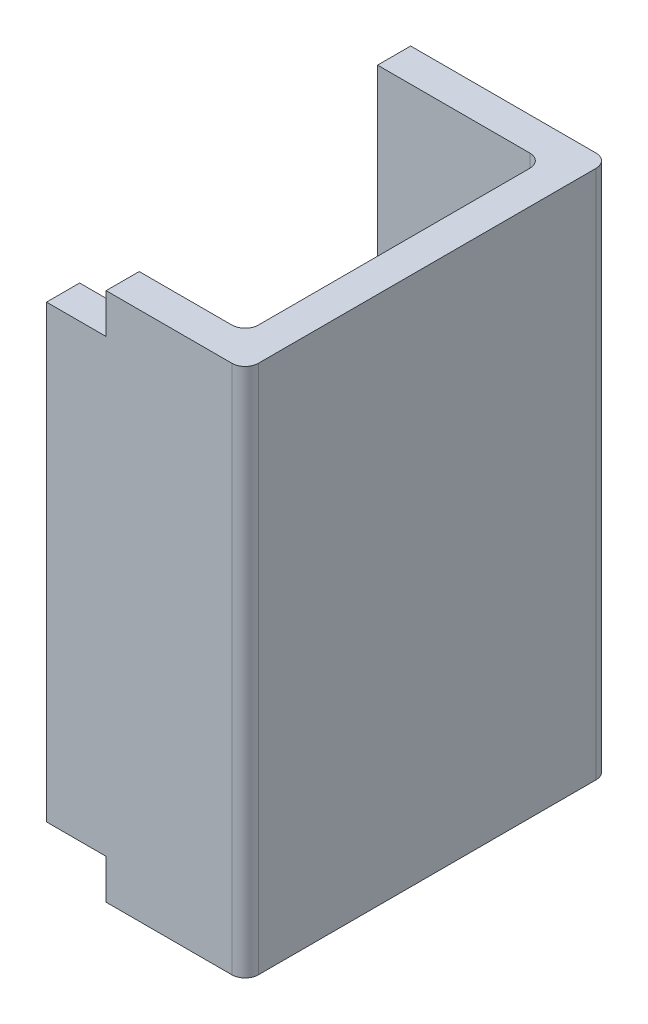
ISO-10303-21;
HEADER;
FILE_DESCRIPTION(('STEP AP214'),'2;1');
FILE_NAME('part.step','',(''),(''),'','','');
FILE_SCHEMA(('AUTOMOTIVE_DESIGN { 1 0 10303 214 1 1 1 1 }'));
ENDSEC;
DATA;
#1=APPLICATION_CONTEXT('core data for automotive mechanical design processes');
#2=APPLICATION_PROTOCOL_DEFINITION('international standard','automotive_design',2000,#1);
#3=PRODUCT_CONTEXT('',#1,'mechanical');
#4=PRODUCT('Part','Part','',(#3));
#5=PRODUCT_RELATED_PRODUCT_CATEGORY('part','',(#4));
#6=PRODUCT_DEFINITION_FORMATION('','',#4);
#7=PRODUCT_DEFINITION_CONTEXT('part definition',#1,'design');
#8=PRODUCT_DEFINITION('design','',#6,#7);
#9=PRODUCT_DEFINITION_SHAPE('','',#8);
#10=(LENGTH_UNIT() NAMED_UNIT(*) SI_UNIT(.MILLI.,.METRE.));
#11=(NAMED_UNIT(*) PLANE_ANGLE_UNIT() SI_UNIT($,.RADIAN.));
#12=(NAMED_UNIT(*) SI_UNIT($,.STERADIAN.) SOLID_ANGLE_UNIT());
#13=UNCERTAINTY_MEASURE_WITH_UNIT(LENGTH_MEASURE(1.E-05),#10,'distance_accuracy_value','');
#14=(GEOMETRIC_REPRESENTATION_CONTEXT(3) GLOBAL_UNCERTAINTY_ASSIGNED_CONTEXT((#13)) GLOBAL_UNIT_ASSIGNED_CONTEXT((#10,
#11,#12)) REPRESENTATION_CONTEXT('',''));
#15=CARTESIAN_POINT('',(0.,0.,0.));
#16=DIRECTION('',(0.,0.,1.));
#17=DIRECTION('',(1.,0.,0.));
#18=AXIS2_PLACEMENT_3D('',#15,#16,#17);
#19=CARTESIAN_POINT('',(0.565,0.34,0.55));
#20=DIRECTION('',(0.,-1.,0.));
#21=DIRECTION('',(0.,0.,-1.));
#22=AXIS2_PLACEMENT_3D('',#19,#20,#21);
#23=PLANE('',#22);
#24=DIRECTION('',(0.,0.,-1.));
#25=VECTOR('',#24,1.);
#26=CARTESIAN_POINT('',(0.475,0.34,0.55));
#27=LINE('',#26,#25);
#28=CARTESIAN_POINT('',(0.475,0.34,0.5));
#29=VERTEX_POINT('',#28);
#30=CARTESIAN_POINT('',(0.475,0.34,0.55));
#31=VERTEX_POINT('',#30);
#32=EDGE_CURVE('E210',#29,#31,#27,.F.);
#33=ORIENTED_EDGE('',*,*,#32,.T.);
#34=DIRECTION('',(1.,0.,0.));
#35=VECTOR('',#34,1.);
#36=CARTESIAN_POINT('',(0.,0.34,0.55));
#37=LINE('',#36,#35);
#38=CARTESIAN_POINT('',(0.565,0.34,0.55));
#39=VERTEX_POINT('',#38);
#40=EDGE_CURVE('E180',#39,#31,#37,.F.);
#41=ORIENTED_EDGE('',*,*,#40,.F.);
#42=DIRECTION('',(0.,0.,-1.));
#43=VECTOR('',#42,1.);
#44=CARTESIAN_POINT('',(0.565,0.34,0.55));
#45=LINE('',#44,#43);
#46=CARTESIAN_POINT('',(0.565,0.34,0.5));
#47=VERTEX_POINT('',#46);
#48=EDGE_CURVE('E181',#39,#47,#45,.T.);
#49=ORIENTED_EDGE('',*,*,#48,.T.);
#50=DIRECTION('',(1.,0.,0.));
#51=VECTOR('',#50,1.);
#52=CARTESIAN_POINT('',(-0.725,0.34,0.5));
#53=LINE('',#52,#51);
#54=EDGE_CURVE('E190',#47,#29,#53,.F.);
#55=ORIENTED_EDGE('',*,*,#54,.T.);
#56=EDGE_LOOP('',(#33,#41,#49,#55));
#57=FACE_BOUND('',#56,.T.);
#58=ADVANCED_FACE('F17',(#57),#23,.F.);
#59=CARTESIAN_POINT('',(0.475,0.4,0.55));
#60=DIRECTION('',(1.,0.,0.));
#61=DIRECTION('',(0.,0.,-1.));
#62=AXIS2_PLACEMENT_3D('',#59,#60,#61);
#63=PLANE('',#62);
#64=DIRECTION('',(0.,1.,0.));
#65=VECTOR('',#64,1.);
#66=CARTESIAN_POINT('',(0.475,0.,0.55));
#67=LINE('',#66,#65);
#68=CARTESIAN_POINT('',(0.475,-0.34,0.55));
#69=VERTEX_POINT('',#68);
#70=EDGE_CURVE('E231',#31,#69,#67,.F.);
#71=ORIENTED_EDGE('',*,*,#70,.F.);
#72=ORIENTED_EDGE('',*,*,#32,.F.);
#73=DIRECTION('',(0.,1.,0.));
#74=VECTOR('',#73,1.);
#75=CARTESIAN_POINT('',(0.475,0.4,0.5));
#76=LINE('',#75,#74);
#77=CARTESIAN_POINT('',(0.475,-0.34,0.5));
#78=VERTEX_POINT('',#77);
#79=EDGE_CURVE('E204',#29,#78,#76,.F.);
#80=ORIENTED_EDGE('',*,*,#79,.T.);
#81=DIRECTION('',(0.,0.,1.));
#82=VECTOR('',#81,1.);
#83=CARTESIAN_POINT('',(0.475,-0.34,0.55));
#84=LINE('',#83,#82);
#85=EDGE_CURVE('E207',#78,#69,#84,.T.);
#86=ORIENTED_EDGE('',*,*,#85,.T.);
#87=EDGE_LOOP('',(#71,#72,#80,#86));
#88=FACE_BOUND('',#87,.T.);
#89=ADVANCED_FACE('F346',(#88),#63,.F.);
#90=CARTESIAN_POINT('',(0.475,-0.34,0.55));
#91=DIRECTION('',(0.,1.,0.));
#92=DIRECTION('',(0.,0.,1.));
#93=AXIS2_PLACEMENT_3D('',#90,#91,#92);
#94=PLANE('',#93);
#95=DIRECTION('',(0.,0.,-1.));
#96=VECTOR('',#95,1.);
#97=CARTESIAN_POINT('',(0.565,-0.34,0.55));
#98=LINE('',#97,#96);
#99=CARTESIAN_POINT('',(0.565,-0.34,0.5));
#100=VERTEX_POINT('',#99);
#101=CARTESIAN_POINT('',(0.565,-0.34,0.55));
#102=VERTEX_POINT('',#101);
#103=EDGE_CURVE('E170',#100,#102,#98,.F.);
#104=ORIENTED_EDGE('',*,*,#103,.T.);
#105=DIRECTION('',(1.,0.,0.));
#106=VECTOR('',#105,1.);
#107=CARTESIAN_POINT('',(0.,-0.34,0.55));
#108=LINE('',#107,#106);
#109=EDGE_CURVE('E199',#69,#102,#108,.T.);
#110=ORIENTED_EDGE('',*,*,#109,.F.);
#111=ORIENTED_EDGE('',*,*,#85,.F.);
#112=DIRECTION('',(1.,0.,0.));
#113=VECTOR('',#112,1.);
#114=CARTESIAN_POINT('',(-0.725,-0.34,0.5));
#115=LINE('',#114,#113);
#116=EDGE_CURVE('E156',#78,#100,#115,.T.);
#117=ORIENTED_EDGE('',*,*,#116,.T.);
#118=EDGE_LOOP('',(#104,#110,#111,#117));
#119=FACE_BOUND('',#118,.T.);
#120=ADVANCED_FACE('F350',(#119),#94,.F.);
#121=CARTESIAN_POINT('',(0.565,0.4,0.55));
#122=DIRECTION('',(1.,0.,0.));
#123=DIRECTION('',(0.,0.,-1.));
#124=AXIS2_PLACEMENT_3D('',#121,#122,#123);
#125=PLANE('',#124);
#126=ORIENTED_EDGE('',*,*,#48,.F.);
#127=DIRECTION('',(0.,1.,0.));
#128=VECTOR('',#127,1.);
#129=CARTESIAN_POINT('',(0.565,0.,0.55));
#130=LINE('',#129,#128);
#131=CARTESIAN_POINT('',(0.565,0.4,0.55));
#132=VERTEX_POINT('',#131);
#133=EDGE_CURVE('E177',#132,#39,#130,.F.);
#134=ORIENTED_EDGE('',*,*,#133,.F.);
#135=DIRECTION('',(0.,0.,1.));
#136=VECTOR('',#135,1.);
#137=CARTESIAN_POINT('',(0.565,0.4,0.));
#138=LINE('',#137,#136);
#139=CARTESIAN_POINT('',(0.565,0.4,0.5));
#140=VERTEX_POINT('',#139);
#141=EDGE_CURVE('E104',#140,#132,#138,.T.);
#142=ORIENTED_EDGE('',*,*,#141,.F.);
#143=DIRECTION('',(0.,1.,0.));
#144=VECTOR('',#143,1.);
#145=CARTESIAN_POINT('',(0.565,0.4,0.5));
#146=LINE('',#145,#144);
#147=EDGE_CURVE('E169',#140,#47,#146,.F.);
#148=ORIENTED_EDGE('',*,*,#147,.T.);
#149=EDGE_LOOP('',(#126,#134,#142,#148));
#150=FACE_BOUND('',#149,.T.);
#151=ADVANCED_FACE('F285',(#150),#125,.F.);
#152=CARTESIAN_POINT('',(0.,0.,0.55));
#153=DIRECTION('',(0.,0.,1.));
#154=DIRECTION('',(1.,0.,0.));
#155=AXIS2_PLACEMENT_3D('',#152,#153,#154);
#156=PLANE('',#155);
#157=DIRECTION('',(0.,1.,0.));
#158=VECTOR('',#157,1.);
#159=CARTESIAN_POINT('',(0.565,-0.34,0.55));
#160=LINE('',#159,#158);
#161=CARTESIAN_POINT('',(0.565,-0.4,0.55));
#162=VERTEX_POINT('',#161);
#163=EDGE_CURVE('E166',#102,#162,#160,.F.);
#164=ORIENTED_EDGE('',*,*,#163,.T.);
#165=DIRECTION('',(1.,0.,0.));
#166=VECTOR('',#165,1.);
#167=CARTESIAN_POINT('',(-0.775,-0.4,0.55));
#168=LINE('',#167,#166);
#169=CARTESIAN_POINT('',(0.755,-0.4,0.55));
#170=VERTEX_POINT('',#169);
#171=EDGE_CURVE('E163',#170,#162,#168,.F.);
#172=ORIENTED_EDGE('',*,*,#171,.F.);
#173=DIRECTION('',(0.,1.,0.));
#174=VECTOR('',#173,1.);
#175=CARTESIAN_POINT('',(0.755,-0.2,0.55));
#176=LINE('',#175,#174);
#177=CARTESIAN_POINT('',(0.755,0.4,0.55));
#178=VERTEX_POINT('',#177);
#179=EDGE_CURVE('E173',#178,#170,#176,.F.);
#180=ORIENTED_EDGE('',*,*,#179,.F.);
#181=DIRECTION('',(1.,0.,0.));
#182=VECTOR('',#181,1.);
#183=CARTESIAN_POINT('',(0.775,0.4,0.55));
#184=LINE('',#183,#182);
#185=EDGE_CURVE('E102',#132,#178,#184,.T.);
#186=ORIENTED_EDGE('',*,*,#185,.F.);
#187=ORIENTED_EDGE('',*,*,#133,.T.);
#188=ORIENTED_EDGE('',*,*,#40,.T.);
#189=ORIENTED_EDGE('',*,*,#70,.T.);
#190=ORIENTED_EDGE('',*,*,#109,.T.);
#191=EDGE_LOOP('',(#164,#172,#180,#186,#187,#188,#189,#190));
#192=FACE_BOUND('',#191,.T.);
#193=ADVANCED_FACE('F292',(#192),#156,.T.);
#194=CARTESIAN_POINT('',(0.565,-0.34,0.55));
#195=DIRECTION('',(1.,0.,0.));
#196=DIRECTION('',(0.,0.,-1.));
#197=AXIS2_PLACEMENT_3D('',#194,#195,#196);
#198=PLANE('',#197);
#199=DIRECTION('',(0.,0.,-1.));
#200=VECTOR('',#199,1.);
#201=CARTESIAN_POINT('',(0.565,-0.4,0.));
#202=LINE('',#201,#200);
#203=CARTESIAN_POINT('',(0.565,-0.4,0.5));
#204=VERTEX_POINT('',#203);
#205=EDGE_CURVE('E159',#162,#204,#202,.T.);
#206=ORIENTED_EDGE('',*,*,#205,.F.);
#207=ORIENTED_EDGE('',*,*,#163,.F.);
#208=ORIENTED_EDGE('',*,*,#103,.F.);
#209=DIRECTION('',(0.,1.,0.));
#210=VECTOR('',#209,1.);
#211=CARTESIAN_POINT('',(0.565,0.4,0.5));
#212=LINE('',#211,#210);
#213=EDGE_CURVE('E153',#100,#204,#212,.F.);
#214=ORIENTED_EDGE('',*,*,#213,.T.);
#215=EDGE_LOOP('',(#206,#207,#208,#214));
#216=FACE_BOUND('',#215,.T.);
#217=ADVANCED_FACE('F353',(#216),#198,.F.);
#218=CARTESIAN_POINT('',(-0.725,0.4,0.5));
#219=DIRECTION('',(0.,0.,1.));
#220=DIRECTION('',(1.,0.,0.));
#221=AXIS2_PLACEMENT_3D('',#218,#219,#220);
#222=PLANE('',#221);
#223=DIRECTION('',(1.,0.,0.));
#224=VECTOR('',#223,1.);
#225=CARTESIAN_POINT('',(-0.775,-0.4,0.5));
#226=LINE('',#225,#224);
#227=CARTESIAN_POINT('',(0.705,-0.4,0.5));
#228=VERTEX_POINT('',#227);
#229=EDGE_CURVE('E162',#204,#228,#226,.T.);
#230=ORIENTED_EDGE('',*,*,#229,.F.);
#231=ORIENTED_EDGE('',*,*,#213,.F.);
#232=ORIENTED_EDGE('',*,*,#116,.F.);
#233=ORIENTED_EDGE('',*,*,#79,.F.);
#234=ORIENTED_EDGE('',*,*,#54,.F.);
#235=ORIENTED_EDGE('',*,*,#147,.F.);
#236=DIRECTION('',(1.,0.,0.));
#237=VECTOR('',#236,1.);
#238=CARTESIAN_POINT('',(0.775,0.4,0.5));
#239=LINE('',#238,#237);
#240=CARTESIAN_POINT('',(0.705,0.4,0.5));
#241=VERTEX_POINT('',#240);
#242=EDGE_CURVE('E107',#241,#140,#239,.F.);
#243=ORIENTED_EDGE('',*,*,#242,.F.);
#244=DIRECTION('',(0.,1.,0.));
#245=VECTOR('',#244,1.);
#246=CARTESIAN_POINT('',(0.705,0.4,0.5));
#247=LINE('',#246,#245);
#248=EDGE_CURVE('E150',#241,#228,#247,.F.);
#249=ORIENTED_EDGE('',*,*,#248,.T.);
#250=EDGE_LOOP('',(#230,#231,#232,#233,#234,#235,#243,#249));
#251=FACE_BOUND('',#250,.T.);
#252=ADVANCED_FACE('F277',(#251),#222,.F.);
#253=CARTESIAN_POINT('',(0.705,0.4,0.48));
#254=DIRECTION('',(0.,1.,0.));
#255=DIRECTION('',(0.,0.,1.));
#256=AXIS2_PLACEMENT_3D('',#253,#254,#255);
#257=CYLINDRICAL_SURFACE('',#256,0.02);
#258=ORIENTED_EDGE('',*,*,#248,.F.);
#259=CARTESIAN_POINT('',(0.705,0.4,0.48));
#260=DIRECTION('',(0.,1.,0.));
#261=DIRECTION('',(0.,0.,1.));
#262=AXIS2_PLACEMENT_3D('',#259,#260,#261);
#263=CIRCLE('',#262,0.02);
#264=CARTESIAN_POINT('',(0.725,0.4,0.48));
#265=VERTEX_POINT('',#264);
#266=EDGE_CURVE('E110',#265,#241,#263,.F.);
#267=ORIENTED_EDGE('',*,*,#266,.F.);
#268=DIRECTION('',(0.,1.,0.));
#269=VECTOR('',#268,1.);
#270=CARTESIAN_POINT('',(0.725,0.4,0.48));
#271=LINE('',#270,#269);
#272=CARTESIAN_POINT('',(0.725,-0.4,0.48));
#273=VERTEX_POINT('',#272);
#274=EDGE_CURVE('E147',#265,#273,#271,.F.);
#275=ORIENTED_EDGE('',*,*,#274,.T.);
#276=CARTESIAN_POINT('',(0.705,-0.4,0.48));
#277=DIRECTION('',(0.,1.,0.));
#278=DIRECTION('',(0.,0.,1.));
#279=AXIS2_PLACEMENT_3D('',#276,#277,#278);
#280=CIRCLE('',#279,0.02);
#281=EDGE_CURVE('E246',#228,#273,#280,.T.);
#282=ORIENTED_EDGE('',*,*,#281,.F.);
#283=EDGE_LOOP('',(#258,#267,#275,#282));
#284=FACE_BOUND('',#283,.T.);
#285=ADVANCED_FACE('F270',(#284),#257,.F.);
#286=CARTESIAN_POINT('',(0.725,0.4,0.5));
#287=DIRECTION('',(1.,0.,0.));
#288=DIRECTION('',(0.,0.,-1.));
#289=AXIS2_PLACEMENT_3D('',#286,#287,#288);
#290=PLANE('',#289);
#291=DIRECTION('',(0.,0.,-1.));
#292=VECTOR('',#291,1.);
#293=CARTESIAN_POINT('',(0.725,-0.4,0.));
#294=LINE('',#293,#292);
#295=CARTESIAN_POINT('',(0.725,-0.4,0.07));
#296=VERTEX_POINT('',#295);
#297=EDGE_CURVE('E245',#273,#296,#294,.T.);
#298=ORIENTED_EDGE('',*,*,#297,.F.);
#299=ORIENTED_EDGE('',*,*,#274,.F.);
#300=DIRECTION('',(0.,0.,1.));
#301=VECTOR('',#300,1.);
#302=CARTESIAN_POINT('',(0.725,0.4,0.));
#303=LINE('',#302,#301);
#304=CARTESIAN_POINT('',(0.725,0.4,0.07));
#305=VERTEX_POINT('',#304);
#306=EDGE_CURVE('E113',#305,#265,#303,.T.);
#307=ORIENTED_EDGE('',*,*,#306,.F.);
#308=DIRECTION('',(0.,-1.,0.));
#309=VECTOR('',#308,1.);
#310=CARTESIAN_POINT('',(0.725,0.4,0.07));
#311=LINE('',#310,#309);
#312=EDGE_CURVE('E144',#305,#296,#311,.T.);
#313=ORIENTED_EDGE('',*,*,#312,.T.);
#314=EDGE_LOOP('',(#298,#299,#307,#313));
#315=FACE_BOUND('',#314,.T.);
#316=ADVANCED_FACE('F266',(#315),#290,.F.);
#317=CARTESIAN_POINT('',(0.705,0.4,0.07));
#318=DIRECTION('',(0.,-1.,0.));
#319=DIRECTION('',(0.,0.,-1.));
#320=AXIS2_PLACEMENT_3D('',#317,#318,#319);
#321=CYLINDRICAL_SURFACE('',#320,0.02);
#322=DIRECTION('',(0.,1.,0.));
#323=VECTOR('',#322,1.);
#324=CARTESIAN_POINT('',(0.705,0.4,0.05));
#325=LINE('',#324,#323);
#326=CARTESIAN_POINT('',(0.705,0.4,0.05));
#327=VERTEX_POINT('',#326);
#328=CARTESIAN_POINT('',(0.705,-0.4,0.05));
#329=VERTEX_POINT('',#328);
#330=EDGE_CURVE('E139',#327,#329,#325,.F.);
#331=ORIENTED_EDGE('',*,*,#330,.T.);
#332=CARTESIAN_POINT('',(0.705,-0.4,0.07));
#333=DIRECTION('',(0.,-1.,0.));
#334=DIRECTION('',(0.,0.,-1.));
#335=AXIS2_PLACEMENT_3D('',#332,#333,#334);
#336=CIRCLE('',#335,0.02);
#337=EDGE_CURVE('E242',#296,#329,#336,.F.);
#338=ORIENTED_EDGE('',*,*,#337,.F.);
#339=ORIENTED_EDGE('',*,*,#312,.F.);
#340=CARTESIAN_POINT('',(0.705,0.4,0.07));
#341=DIRECTION('',(0.,-1.,0.));
#342=DIRECTION('',(0.,0.,-1.));
#343=AXIS2_PLACEMENT_3D('',#340,#341,#342);
#344=CIRCLE('',#343,0.02);
#345=EDGE_CURVE('E116',#327,#305,#344,.T.);
#346=ORIENTED_EDGE('',*,*,#345,.F.);
#347=EDGE_LOOP('',(#331,#338,#339,#346));
#348=FACE_BOUND('',#347,.T.);
#349=ADVANCED_FACE('F258',(#348),#321,.F.);
#350=CARTESIAN_POINT('',(0.725,0.4,0.05));
#351=DIRECTION('',(0.,0.,-1.));
#352=DIRECTION('',(-1.,0.,0.));
#353=AXIS2_PLACEMENT_3D('',#350,#351,#352);
#354=PLANE('',#353);
#355=DIRECTION('',(1.,0.,0.));
#356=VECTOR('',#355,1.);
#357=CARTESIAN_POINT('',(0.775,0.4,0.05));
#358=LINE('',#357,#356);
#359=CARTESIAN_POINT('',(0.475,0.4,0.05));
#360=VERTEX_POINT('',#359);
#361=EDGE_CURVE('E117',#360,#327,#358,.T.);
#362=ORIENTED_EDGE('',*,*,#361,.F.);
#363=DIRECTION('',(0.,1.,0.));
#364=VECTOR('',#363,1.);
#365=CARTESIAN_POINT('',(0.475,0.4,0.05));
#366=LINE('',#365,#364);
#367=CARTESIAN_POINT('',(0.475,-0.4,0.05));
#368=VERTEX_POINT('',#367);
#369=EDGE_CURVE('E129',#360,#368,#366,.F.);
#370=ORIENTED_EDGE('',*,*,#369,.T.);
#371=DIRECTION('',(1.,0.,0.));
#372=VECTOR('',#371,1.);
#373=CARTESIAN_POINT('',(-0.775,-0.4,0.05));
#374=LINE('',#373,#372);
#375=EDGE_CURVE('E134',#329,#368,#374,.F.);
#376=ORIENTED_EDGE('',*,*,#375,.F.);
#377=ORIENTED_EDGE('',*,*,#330,.F.);
#378=EDGE_LOOP('',(#362,#370,#376,#377));
#379=FACE_BOUND('',#378,.T.);
#380=ADVANCED_FACE('F316',(#379),#354,.F.);
#381=CARTESIAN_POINT('',(0.475,0.4,0.137097424126));
#382=DIRECTION('',(1.,0.,0.));
#383=DIRECTION('',(0.,0.,-1.));
#384=AXIS2_PLACEMENT_3D('',#381,#382,#383);
#385=PLANE('',#384);
#386=ORIENTED_EDGE('',*,*,#369,.F.);
#387=DIRECTION('',(0.,0.,1.));
#388=VECTOR('',#387,1.);
#389=CARTESIAN_POINT('',(0.475,0.4,0.));
#390=LINE('',#389,#388);
#391=CARTESIAN_POINT('',(0.475,0.4,0.));
#392=VERTEX_POINT('',#391);
#393=EDGE_CURVE('E120',#392,#360,#390,.T.);
#394=ORIENTED_EDGE('',*,*,#393,.F.);
#395=DIRECTION('',(0.,1.,0.));
#396=VECTOR('',#395,1.);
#397=CARTESIAN_POINT('',(0.475,0.,0.));
#398=LINE('',#397,#396);
#399=CARTESIAN_POINT('',(0.475,-0.4,0.));
#400=VERTEX_POINT('',#399);
#401=EDGE_CURVE('E126',#392,#400,#398,.F.);
#402=ORIENTED_EDGE('',*,*,#401,.T.);
#403=DIRECTION('',(0.,0.,-1.));
#404=VECTOR('',#403,1.);
#405=CARTESIAN_POINT('',(0.475,-0.4,0.));
#406=LINE('',#405,#404);
#407=EDGE_CURVE('E98',#368,#400,#406,.T.);
#408=ORIENTED_EDGE('',*,*,#407,.F.);
#409=EDGE_LOOP('',(#386,#394,#402,#408));
#410=FACE_BOUND('',#409,.T.);
#411=ADVANCED_FACE('F363',(#410),#385,.F.);
#412=CARTESIAN_POINT('',(0.,0.,0.));
#413=DIRECTION('',(0.,0.,1.));
#414=DIRECTION('',(1.,0.,0.));
#415=AXIS2_PLACEMENT_3D('',#412,#413,#414);
#416=PLANE('',#415);
#417=DIRECTION('',(1.,0.,0.));
#418=VECTOR('',#417,1.);
#419=CARTESIAN_POINT('',(-0.775,-0.4,0.));
#420=LINE('',#419,#418);
#421=CARTESIAN_POINT('',(0.755,-0.4,0.));
#422=VERTEX_POINT('',#421);
#423=EDGE_CURVE('E95',#400,#422,#420,.T.);
#424=ORIENTED_EDGE('',*,*,#423,.F.);
#425=ORIENTED_EDGE('',*,*,#401,.F.);
#426=DIRECTION('',(1.,0.,0.));
#427=VECTOR('',#426,1.);
#428=CARTESIAN_POINT('',(0.775,0.4,0.));
#429=LINE('',#428,#427);
#430=CARTESIAN_POINT('',(0.755,0.4,0.));
#431=VERTEX_POINT('',#430);
#432=EDGE_CURVE('E85',#431,#392,#429,.F.);
#433=ORIENTED_EDGE('',*,*,#432,.F.);
#434=DIRECTION('',(0.,1.,0.));
#435=VECTOR('',#434,1.);
#436=CARTESIAN_POINT('',(0.755,-0.2,0.));
#437=LINE('',#436,#435);
#438=EDGE_CURVE('E81',#422,#431,#437,.T.);
#439=ORIENTED_EDGE('',*,*,#438,.F.);
#440=EDGE_LOOP('',(#424,#425,#433,#439));
#441=FACE_BOUND('',#440,.T.);
#442=ADVANCED_FACE('F357',(#441),#416,.F.);
#443=CARTESIAN_POINT('',(0.755,-0.2,0.02));
#444=DIRECTION('',(0.,1.,0.));
#445=DIRECTION('',(0.,0.,1.));
#446=AXIS2_PLACEMENT_3D('',#443,#444,#445);
#447=CYLINDRICAL_SURFACE('',#446,0.02);
#448=CARTESIAN_POINT('',(0.755,-0.4,0.02));
#449=DIRECTION('',(0.,1.,0.));
#450=DIRECTION('',(0.,0.,1.));
#451=AXIS2_PLACEMENT_3D('',#448,#449,#450);
#452=CIRCLE('',#451,0.02);
#453=CARTESIAN_POINT('',(0.775,-0.4,0.02));
#454=VERTEX_POINT('',#453);
#455=EDGE_CURVE('E175',#422,#454,#452,.F.);
#456=ORIENTED_EDGE('',*,*,#455,.F.);
#457=ORIENTED_EDGE('',*,*,#438,.T.);
#458=CARTESIAN_POINT('',(0.755,0.4,0.02));
#459=DIRECTION('',(0.,1.,0.));
#460=DIRECTION('',(0.,0.,1.));
#461=AXIS2_PLACEMENT_3D('',#458,#459,#460);
#462=CIRCLE('',#461,0.02);
#463=CARTESIAN_POINT('',(0.775,0.4,0.02));
#464=VERTEX_POINT('',#463);
#465=EDGE_CURVE('E20',#464,#431,#462,.T.);
#466=ORIENTED_EDGE('',*,*,#465,.F.);
#467=DIRECTION('',(0.,1.,0.));
#468=VECTOR('',#467,1.);
#469=CARTESIAN_POINT('',(0.775,-0.4,0.02));
#470=LINE('',#469,#468);
#471=EDGE_CURVE('E79',#454,#464,#470,.T.);
#472=ORIENTED_EDGE('',*,*,#471,.F.);
#473=EDGE_LOOP('',(#456,#457,#466,#472));
#474=FACE_BOUND('',#473,.T.);
#475=ADVANCED_FACE('F77',(#474),#447,.T.);
#476=CARTESIAN_POINT('',(0.775,0.4,0.));
#477=DIRECTION('',(0.,1.,0.));
#478=DIRECTION('',(0.,0.,1.));
#479=AXIS2_PLACEMENT_3D('',#476,#477,#478);
#480=PLANE('',#479);
#481=CARTESIAN_POINT('',(0.755,0.4,0.53));
#482=DIRECTION('',(0.,1.,0.));
#483=DIRECTION('',(0.,0.,1.));
#484=AXIS2_PLACEMENT_3D('',#481,#482,#483);
#485=CIRCLE('',#484,0.02);
#486=CARTESIAN_POINT('',(0.775,0.4,0.53));
#487=VERTEX_POINT('',#486);
#488=EDGE_CURVE('E90',#487,#178,#485,.F.);
#489=ORIENTED_EDGE('',*,*,#488,.F.);
#490=DIRECTION('',(0.,0.,-1.));
#491=VECTOR('',#490,1.);
#492=CARTESIAN_POINT('',(0.775,0.4,0.));
#493=LINE('',#492,#491);
#494=EDGE_CURVE('E87',#464,#487,#493,.F.);
#495=ORIENTED_EDGE('',*,*,#494,.F.);
#496=ORIENTED_EDGE('',*,*,#465,.T.);
#497=ORIENTED_EDGE('',*,*,#432,.T.);
#498=ORIENTED_EDGE('',*,*,#393,.T.);
#499=ORIENTED_EDGE('',*,*,#361,.T.);
#500=ORIENTED_EDGE('',*,*,#345,.T.);
#501=ORIENTED_EDGE('',*,*,#306,.T.);
#502=ORIENTED_EDGE('',*,*,#266,.T.);
#503=ORIENTED_EDGE('',*,*,#242,.T.);
#504=ORIENTED_EDGE('',*,*,#141,.T.);
#505=ORIENTED_EDGE('',*,*,#185,.T.);
#506=EDGE_LOOP('',(#489,#495,#496,#497,#498,#499,#500,#501,#502,#503,#504,#505));
#507=FACE_BOUND('',#506,.T.);
#508=ADVANCED_FACE('F88',(#507),#480,.T.);
#509=CARTESIAN_POINT('',(0.755,-0.2,0.53));
#510=DIRECTION('',(0.,1.,0.));
#511=DIRECTION('',(0.,0.,1.));
#512=AXIS2_PLACEMENT_3D('',#509,#510,#511);
#513=CYLINDRICAL_SURFACE('',#512,0.02);
#514=CARTESIAN_POINT('',(0.755,-0.4,0.53));
#515=DIRECTION('',(0.,1.,0.));
#516=DIRECTION('',(0.,0.,1.));
#517=AXIS2_PLACEMENT_3D('',#514,#515,#516);
#518=CIRCLE('',#517,0.02);
#519=CARTESIAN_POINT('',(0.775,-0.4,0.53));
#520=VERTEX_POINT('',#519);
#521=EDGE_CURVE('E35',#520,#170,#518,.F.);
#522=ORIENTED_EDGE('',*,*,#521,.F.);
#523=DIRECTION('',(0.,1.,0.));
#524=VECTOR('',#523,1.);
#525=CARTESIAN_POINT('',(0.775,-0.4,0.53));
#526=LINE('',#525,#524);
#527=EDGE_CURVE('E26',#487,#520,#526,.F.);
#528=ORIENTED_EDGE('',*,*,#527,.F.);
#529=ORIENTED_EDGE('',*,*,#488,.T.);
#530=ORIENTED_EDGE('',*,*,#179,.T.);
#531=EDGE_LOOP('',(#522,#528,#529,#530));
#532=FACE_BOUND('',#531,.T.);
#533=ADVANCED_FACE('F295',(#532),#513,.T.);
#534=CARTESIAN_POINT('',(-0.775,-0.4,0.));
#535=DIRECTION('',(0.,-1.,0.));
#536=DIRECTION('',(0.,0.,-1.));
#537=AXIS2_PLACEMENT_3D('',#534,#535,#536);
#538=PLANE('',#537);
#539=ORIENTED_EDGE('',*,*,#407,.T.);
#540=ORIENTED_EDGE('',*,*,#423,.T.);
#541=ORIENTED_EDGE('',*,*,#455,.T.);
#542=DIRECTION('',(0.,0.,-1.));
#543=VECTOR('',#542,1.);
#544=CARTESIAN_POINT('',(0.775,-0.4,0.));
#545=LINE('',#544,#543);
#546=EDGE_CURVE('E11',#520,#454,#545,.T.);
#547=ORIENTED_EDGE('',*,*,#546,.F.);
#548=ORIENTED_EDGE('',*,*,#521,.T.);
#549=ORIENTED_EDGE('',*,*,#171,.T.);
#550=ORIENTED_EDGE('',*,*,#205,.T.);
#551=ORIENTED_EDGE('',*,*,#229,.T.);
#552=ORIENTED_EDGE('',*,*,#281,.T.);
#553=ORIENTED_EDGE('',*,*,#297,.T.);
#554=ORIENTED_EDGE('',*,*,#337,.T.);
#555=ORIENTED_EDGE('',*,*,#375,.T.);
#556=EDGE_LOOP('',(#539,#540,#541,#547,#548,#549,#550,#551,#552,#553,#554,#555));
#557=FACE_BOUND('',#556,.T.);
#558=ADVANCED_FACE('F312',(#557),#538,.T.);
#559=CARTESIAN_POINT('',(0.775,-0.4,0.));
#560=DIRECTION('',(1.,0.,0.));
#561=DIRECTION('',(0.,0.,-1.));
#562=AXIS2_PLACEMENT_3D('',#559,#560,#561);
#563=PLANE('',#562);
#564=ORIENTED_EDGE('',*,*,#527,.T.);
#565=ORIENTED_EDGE('',*,*,#546,.T.);
#566=ORIENTED_EDGE('',*,*,#471,.T.);
#567=ORIENTED_EDGE('',*,*,#494,.T.);
#568=EDGE_LOOP('',(#564,#565,#566,#567));
#569=FACE_BOUND('',#568,.T.);
#570=ADVANCED_FACE('F94',(#569),#563,.T.);
#571=CLOSED_SHELL('',(#58,#89,#120,#151,#193,#217,#252,#285,#316,#349,#380,#411,#442,#475,#508,
#533,#558,#570));
#572=MANIFOLD_SOLID_BREP('B1',#571);
#573=ADVANCED_BREP_SHAPE_REPRESENTATION('',(#18,#572),#14);
#574=SHAPE_DEFINITION_REPRESENTATION(#9,#573);
ENDSEC;
END-ISO-10303-21;
